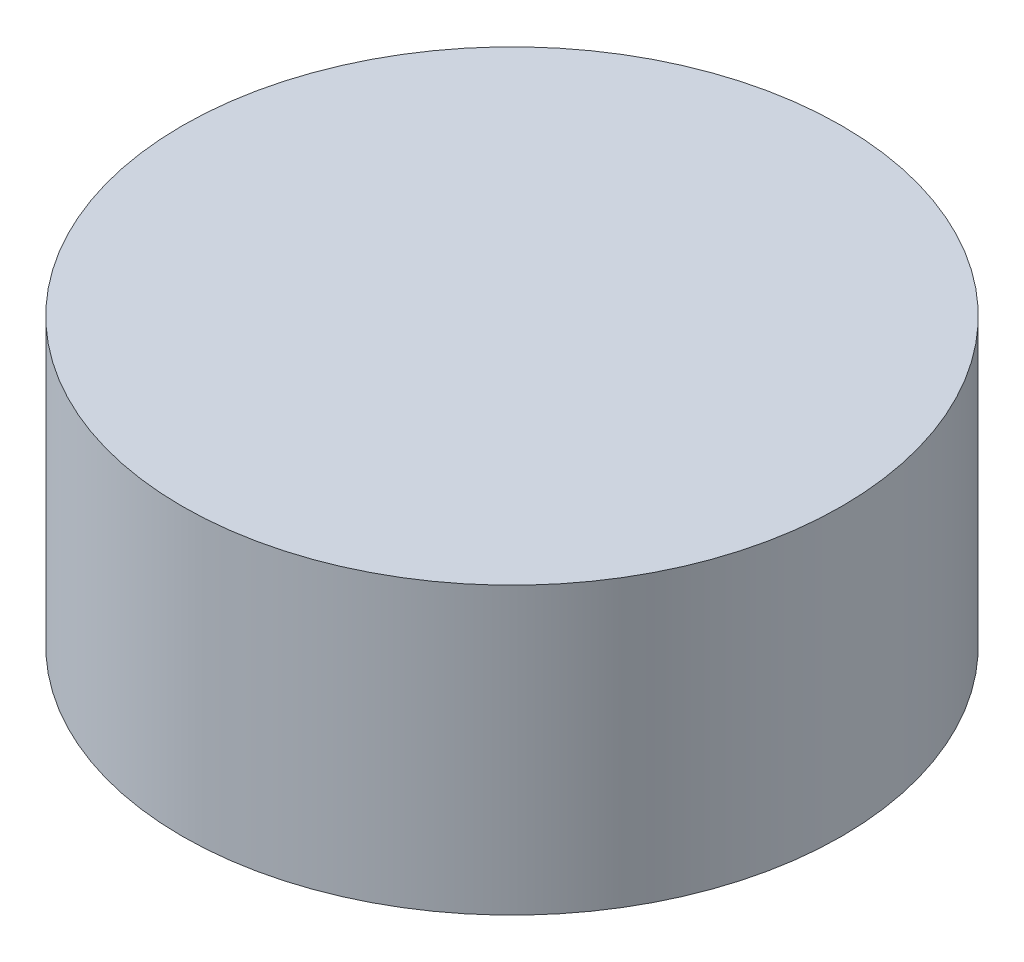
ISO-10303-21;
HEADER;
FILE_DESCRIPTION(('STEP AP214'),'2;1');
FILE_NAME('part.step','',(''),(''),'','','');
FILE_SCHEMA(('AUTOMOTIVE_DESIGN { 1 0 10303 214 1 1 1 1 }'));
ENDSEC;
DATA;
#1=APPLICATION_CONTEXT('core data for automotive mechanical design processes');
#2=APPLICATION_PROTOCOL_DEFINITION('international standard','automotive_design',2000,#1);
#3=PRODUCT_CONTEXT('',#1,'mechanical');
#4=PRODUCT('Part','Part','',(#3));
#5=PRODUCT_RELATED_PRODUCT_CATEGORY('part','',(#4));
#6=PRODUCT_DEFINITION_FORMATION('','',#4);
#7=PRODUCT_DEFINITION_CONTEXT('part definition',#1,'design');
#8=PRODUCT_DEFINITION('design','',#6,#7);
#9=PRODUCT_DEFINITION_SHAPE('','',#8);
#10=(LENGTH_UNIT() NAMED_UNIT(*) SI_UNIT(.MILLI.,.METRE.));
#11=(NAMED_UNIT(*) PLANE_ANGLE_UNIT() SI_UNIT($,.RADIAN.));
#12=(NAMED_UNIT(*) SI_UNIT($,.STERADIAN.) SOLID_ANGLE_UNIT());
#13=UNCERTAINTY_MEASURE_WITH_UNIT(LENGTH_MEASURE(1.E-05),#10,'distance_accuracy_value','');
#14=(GEOMETRIC_REPRESENTATION_CONTEXT(3) GLOBAL_UNCERTAINTY_ASSIGNED_CONTEXT((#13)) GLOBAL_UNIT_ASSIGNED_CONTEXT((#10,
#11,#12)) REPRESENTATION_CONTEXT('',''));
#15=CARTESIAN_POINT('',(0.,0.,0.));
#16=DIRECTION('',(0.,0.,1.));
#17=DIRECTION('',(1.,0.,0.));
#18=AXIS2_PLACEMENT_3D('',#15,#16,#17);
#19=CARTESIAN_POINT('',(0.,7.8,0.));
#20=DIRECTION('',(0.,-1.,0.));
#21=DIRECTION('',(0.,0.,-1.));
#22=AXIS2_PLACEMENT_3D('',#19,#20,#21);
#23=CYLINDRICAL_SURFACE('',#22,9.);
#24=CARTESIAN_POINT('',(0.,7.8,0.));
#25=DIRECTION('',(0.,1.,0.));
#26=DIRECTION('',(0.,0.,1.));
#27=AXIS2_PLACEMENT_3D('',#24,#25,#26);
#28=CIRCLE('',#27,9.);
#29=CARTESIAN_POINT('',(0.,7.8,9.));
#30=VERTEX_POINT('',#29);
#31=EDGE_CURVE('E10',#30,#30,#28,.T.);
#32=ORIENTED_EDGE('',*,*,#31,.F.);
#33=EDGE_LOOP('',(#32));
#34=FACE_BOUND('',#33,.T.);
#35=CARTESIAN_POINT('',(0.,0.,0.));
#36=DIRECTION('',(0.,1.,0.));
#37=DIRECTION('',(0.,0.,1.));
#38=AXIS2_PLACEMENT_3D('',#35,#36,#37);
#39=CIRCLE('',#38,9.);
#40=CARTESIAN_POINT('',(0.,0.,9.));
#41=VERTEX_POINT('',#40);
#42=EDGE_CURVE('E47',#41,#41,#39,.T.);
#43=ORIENTED_EDGE('',*,*,#42,.T.);
#44=EDGE_LOOP('',(#43));
#45=FACE_BOUND('',#44,.T.);
#46=ADVANCED_FACE('F44',(#34,#45),#23,.T.);
#47=CARTESIAN_POINT('',(0.,7.8,0.));
#48=DIRECTION('',(0.,1.,0.));
#49=DIRECTION('',(0.,0.,1.));
#50=AXIS2_PLACEMENT_3D('',#47,#48,#49);
#51=PLANE('',#50);
#52=ORIENTED_EDGE('',*,*,#31,.T.);
#53=EDGE_LOOP('',(#52));
#54=FACE_BOUND('',#53,.T.);
#55=ADVANCED_FACE('F63',(#54),#51,.T.);
#56=CARTESIAN_POINT('',(0.,0.,0.));
#57=DIRECTION('',(0.,1.,0.));
#58=DIRECTION('',(0.,0.,1.));
#59=AXIS2_PLACEMENT_3D('',#56,#57,#58);
#60=PLANE('',#59);
#61=ORIENTED_EDGE('',*,*,#42,.F.);
#62=EDGE_LOOP('',(#61));
#63=FACE_BOUND('',#62,.T.);
#64=ADVANCED_FACE('F61',(#63),#60,.F.);
#65=CLOSED_SHELL('',(#46,#55,#64));
#66=MANIFOLD_SOLID_BREP('B2',#65);
#67=ADVANCED_BREP_SHAPE_REPRESENTATION('',(#18,#66),#14);
#68=SHAPE_DEFINITION_REPRESENTATION(#9,#67);
ENDSEC;
END-ISO-10303-21;
